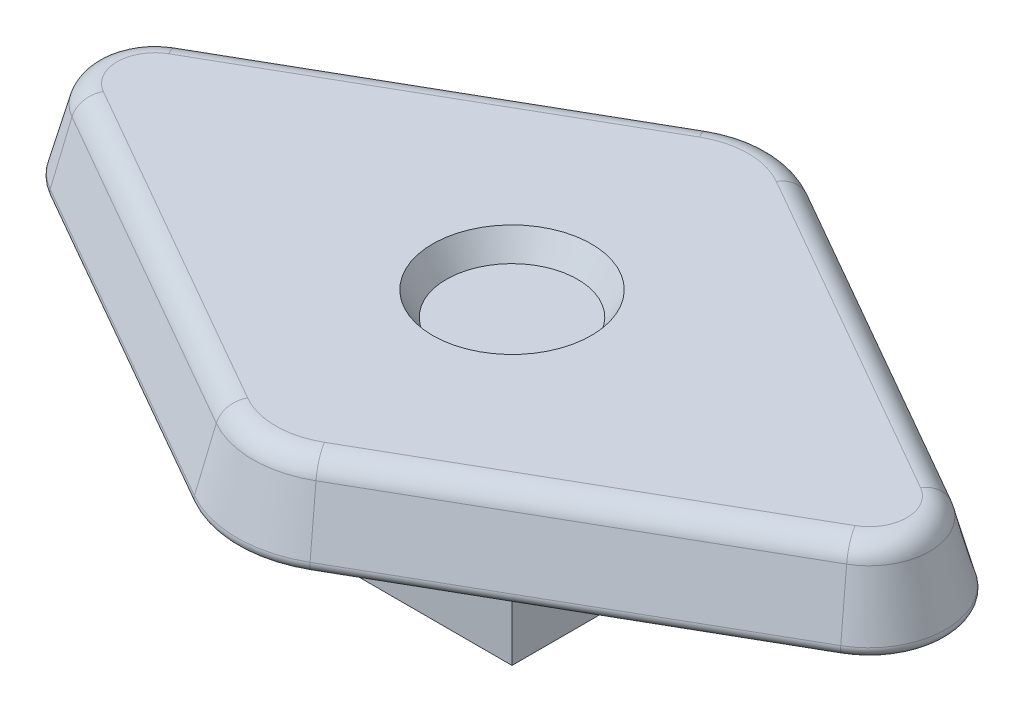
ISO-10303-21;
HEADER;
FILE_DESCRIPTION(('STEP AP214'),'2;1');
FILE_NAME('part.step','',(''),(''),'','','');
FILE_SCHEMA(('AUTOMOTIVE_DESIGN { 1 0 10303 214 1 1 1 1 }'));
ENDSEC;
DATA;
#1=APPLICATION_CONTEXT('core data for automotive mechanical design processes');
#2=APPLICATION_PROTOCOL_DEFINITION('international standard','automotive_design',2000,#1);
#3=PRODUCT_CONTEXT('',#1,'mechanical');
#4=PRODUCT('Part','Part','',(#3));
#5=PRODUCT_RELATED_PRODUCT_CATEGORY('part','',(#4));
#6=PRODUCT_DEFINITION_FORMATION('','',#4);
#7=PRODUCT_DEFINITION_CONTEXT('part definition',#1,'design');
#8=PRODUCT_DEFINITION('design','',#6,#7);
#9=PRODUCT_DEFINITION_SHAPE('','',#8);
#10=(LENGTH_UNIT() NAMED_UNIT(*) SI_UNIT(.MILLI.,.METRE.));
#11=(NAMED_UNIT(*) PLANE_ANGLE_UNIT() SI_UNIT($,.RADIAN.));
#12=(NAMED_UNIT(*) SI_UNIT($,.STERADIAN.) SOLID_ANGLE_UNIT());
#13=UNCERTAINTY_MEASURE_WITH_UNIT(LENGTH_MEASURE(1.E-05),#10,'distance_accuracy_value','');
#14=(GEOMETRIC_REPRESENTATION_CONTEXT(3) GLOBAL_UNCERTAINTY_ASSIGNED_CONTEXT((#13)) GLOBAL_UNIT_ASSIGNED_CONTEXT((#10,
#11,#12)) REPRESENTATION_CONTEXT('',''));
#15=CARTESIAN_POINT('',(0.,0.,0.));
#16=DIRECTION('',(0.,0.,1.));
#17=DIRECTION('',(1.,0.,0.));
#18=AXIS2_PLACEMENT_3D('',#15,#16,#17);
#19=CARTESIAN_POINT('',(1.27,2.54,1.27));
#20=DIRECTION('',(-1.,0.,0.));
#21=DIRECTION('',(0.,0.,1.));
#22=AXIS2_PLACEMENT_3D('',#19,#20,#21);
#23=PLANE('',#22);
#24=DIRECTION('',(0.,0.,-1.));
#25=VECTOR('',#24,1.);
#26=CARTESIAN_POINT('',(1.27,0.,1.27));
#27=LINE('',#26,#25);
#28=CARTESIAN_POINT('',(1.27,0.,1.27));
#29=VERTEX_POINT('',#28);
#30=CARTESIAN_POINT('',(1.27,0.,-1.27));
#31=VERTEX_POINT('',#30);
#32=EDGE_CURVE('E204',#29,#31,#27,.T.);
#33=ORIENTED_EDGE('',*,*,#32,.T.);
#34=DIRECTION('',(0.,-1.,0.));
#35=VECTOR('',#34,1.);
#36=CARTESIAN_POINT('',(1.27,2.54,-1.27));
#37=LINE('',#36,#35);
#38=CARTESIAN_POINT('',(1.27,2.54,-1.27));
#39=VERTEX_POINT('',#38);
#40=EDGE_CURVE('E181',#39,#31,#37,.T.);
#41=ORIENTED_EDGE('',*,*,#40,.F.);
#42=DIRECTION('',(0.,0.,-1.));
#43=VECTOR('',#42,1.);
#44=CARTESIAN_POINT('',(1.27,2.54,1.27));
#45=LINE('',#44,#43);
#46=CARTESIAN_POINT('',(1.27,2.54,1.27));
#47=VERTEX_POINT('',#46);
#48=EDGE_CURVE('E175',#47,#39,#45,.T.);
#49=ORIENTED_EDGE('',*,*,#48,.F.);
#50=DIRECTION('',(0.,-1.,0.));
#51=VECTOR('',#50,1.);
#52=CARTESIAN_POINT('',(1.27,2.54,1.27));
#53=LINE('',#52,#51);
#54=EDGE_CURVE('E178',#47,#29,#53,.T.);
#55=ORIENTED_EDGE('',*,*,#54,.T.);
#56=EDGE_LOOP('',(#33,#41,#49,#55));
#57=FACE_BOUND('',#56,.T.);
#58=ADVANCED_FACE('F35',(#57),#23,.F.);
#59=CARTESIAN_POINT('',(-1.27,2.54,-1.27));
#60=DIRECTION('',(0.,0.,1.));
#61=DIRECTION('',(1.,0.,0.));
#62=AXIS2_PLACEMENT_3D('',#59,#60,#61);
#63=PLANE('',#62);
#64=DIRECTION('',(-1.,0.,0.));
#65=VECTOR('',#64,1.);
#66=CARTESIAN_POINT('',(-1.27,0.,-1.27));
#67=LINE('',#66,#65);
#68=CARTESIAN_POINT('',(-1.27,0.,-1.27));
#69=VERTEX_POINT('',#68);
#70=EDGE_CURVE('E206',#31,#69,#67,.T.);
#71=ORIENTED_EDGE('',*,*,#70,.T.);
#72=DIRECTION('',(0.,-1.,0.));
#73=VECTOR('',#72,1.);
#74=CARTESIAN_POINT('',(-1.27,2.54,-1.27));
#75=LINE('',#74,#73);
#76=CARTESIAN_POINT('',(-1.27,2.54,-1.27));
#77=VERTEX_POINT('',#76);
#78=EDGE_CURVE('E213',#77,#69,#75,.T.);
#79=ORIENTED_EDGE('',*,*,#78,.F.);
#80=DIRECTION('',(-1.,0.,0.));
#81=VECTOR('',#80,1.);
#82=CARTESIAN_POINT('',(-1.27,2.54,-1.27));
#83=LINE('',#82,#81);
#84=EDGE_CURVE('E185',#39,#77,#83,.T.);
#85=ORIENTED_EDGE('',*,*,#84,.F.);
#86=ORIENTED_EDGE('',*,*,#40,.T.);
#87=EDGE_LOOP('',(#71,#79,#85,#86));
#88=FACE_BOUND('',#87,.T.);
#89=ADVANCED_FACE('F381',(#88),#63,.F.);
#90=CARTESIAN_POINT('',(-1.27,2.54,1.27));
#91=DIRECTION('',(1.,0.,0.));
#92=DIRECTION('',(0.,0.,-1.));
#93=AXIS2_PLACEMENT_3D('',#90,#91,#92);
#94=PLANE('',#93);
#95=DIRECTION('',(0.,0.,1.));
#96=VECTOR('',#95,1.);
#97=CARTESIAN_POINT('',(-1.27,0.,1.27));
#98=LINE('',#97,#96);
#99=CARTESIAN_POINT('',(-1.27,0.,1.27));
#100=VERTEX_POINT('',#99);
#101=EDGE_CURVE('E209',#69,#100,#98,.T.);
#102=ORIENTED_EDGE('',*,*,#101,.T.);
#103=DIRECTION('',(0.,-1.,0.));
#104=VECTOR('',#103,1.);
#105=CARTESIAN_POINT('',(-1.27,2.54,1.27));
#106=LINE('',#105,#104);
#107=CARTESIAN_POINT('',(-1.27,2.54,1.27));
#108=VERTEX_POINT('',#107);
#109=EDGE_CURVE('E195',#108,#100,#106,.T.);
#110=ORIENTED_EDGE('',*,*,#109,.F.);
#111=DIRECTION('',(0.,0.,1.));
#112=VECTOR('',#111,1.);
#113=CARTESIAN_POINT('',(-1.27,2.54,1.27));
#114=LINE('',#113,#112);
#115=EDGE_CURVE('E199',#77,#108,#114,.T.);
#116=ORIENTED_EDGE('',*,*,#115,.F.);
#117=ORIENTED_EDGE('',*,*,#78,.T.);
#118=EDGE_LOOP('',(#102,#110,#116,#117));
#119=FACE_BOUND('',#118,.T.);
#120=ADVANCED_FACE('F384',(#119),#94,.F.);
#121=CARTESIAN_POINT('',(-1.27,2.54,1.27));
#122=DIRECTION('',(0.,0.,-1.));
#123=DIRECTION('',(-1.,0.,0.));
#124=AXIS2_PLACEMENT_3D('',#121,#122,#123);
#125=PLANE('',#124);
#126=DIRECTION('',(1.,0.,0.));
#127=VECTOR('',#126,1.);
#128=CARTESIAN_POINT('',(-1.27,0.,1.27));
#129=LINE('',#128,#127);
#130=EDGE_CURVE('E186',#100,#29,#129,.T.);
#131=ORIENTED_EDGE('',*,*,#130,.T.);
#132=ORIENTED_EDGE('',*,*,#54,.F.);
#133=DIRECTION('',(1.,0.,0.));
#134=VECTOR('',#133,1.);
#135=CARTESIAN_POINT('',(-1.27,2.54,1.27));
#136=LINE('',#135,#134);
#137=EDGE_CURVE('E192',#108,#47,#136,.T.);
#138=ORIENTED_EDGE('',*,*,#137,.F.);
#139=ORIENTED_EDGE('',*,*,#109,.T.);
#140=EDGE_LOOP('',(#131,#132,#138,#139));
#141=FACE_BOUND('',#140,.T.);
#142=ADVANCED_FACE('F190',(#141),#125,.F.);
#143=CARTESIAN_POINT('',(0.,0.,0.));
#144=DIRECTION('',(0.,-1.,0.));
#145=DIRECTION('',(0.,0.,-1.));
#146=AXIS2_PLACEMENT_3D('',#143,#144,#145);
#147=PLANE('',#146);
#148=ORIENTED_EDGE('',*,*,#32,.F.);
#149=ORIENTED_EDGE('',*,*,#130,.F.);
#150=ORIENTED_EDGE('',*,*,#101,.F.);
#151=ORIENTED_EDGE('',*,*,#70,.F.);
#152=EDGE_LOOP('',(#148,#149,#150,#151));
#153=FACE_BOUND('',#152,.T.);
#154=ADVANCED_FACE('F386',(#153),#147,.T.);
#155=CARTESIAN_POINT('',(0.,2.54,-2.54));
#156=DIRECTION('',(0.,-1.,0.));
#157=DIRECTION('',(0.,0.,-1.));
#158=AXIS2_PLACEMENT_3D('',#155,#156,#157);
#159=PLANE('',#158);
#160=CARTESIAN_POINT('',(-5.715,2.54,0.));
#161=DIRECTION('',(0.,-1.,0.));
#162=DIRECTION('',(0.,0.,-1.));
#163=AXIS2_PLACEMENT_3D('',#160,#161,#162);
#164=CIRCLE('',#163,1.10449037764917);
#165=CARTESIAN_POINT('',(-6.2637362785125,2.54,0.958534032240823));
#166=VERTEX_POINT('',#165);
#167=CARTESIAN_POINT('',(-6.2637362785125,2.54,-0.958534032240823));
#168=VERTEX_POINT('',#167);
#169=EDGE_CURVE('E277',#166,#168,#164,.T.);
#170=ORIENTED_EDGE('',*,*,#169,.T.);
#171=DIRECTION('',(0.867851863300973,0.,-0.496823050355988));
#172=VECTOR('',#171,1.);
#173=CARTESIAN_POINT('',(-0.864218915488549,2.54,-4.04961996543694));
#174=LINE('',#173,#172);
#175=CARTESIAN_POINT('',(-0.864218915488549,2.54,-4.04961996543694));
#176=VERTEX_POINT('',#175);
#177=EDGE_CURVE('E291',#168,#176,#174,.T.);
#178=ORIENTED_EDGE('',*,*,#177,.T.);
#179=CARTESIAN_POINT('',(0.,2.54,-2.54));
#180=DIRECTION('',(0.,-1.,0.));
#181=DIRECTION('',(0.,0.,-1.));
#182=AXIS2_PLACEMENT_3D('',#179,#180,#181);
#183=CIRCLE('',#182,1.73949037764917);
#184=CARTESIAN_POINT('',(0.864218915488548,2.54,-4.04961996543694));
#185=VERTEX_POINT('',#184);
#186=EDGE_CURVE('E289',#176,#185,#183,.T.);
#187=ORIENTED_EDGE('',*,*,#186,.T.);
#188=DIRECTION('',(0.867851863300973,0.,0.496823050355988));
#189=VECTOR('',#188,1.);
#190=CARTESIAN_POINT('',(6.2637362785125,2.54,-0.958534032240823));
#191=LINE('',#190,#189);
#192=CARTESIAN_POINT('',(6.2637362785125,2.54,-0.958534032240823));
#193=VERTEX_POINT('',#192);
#194=EDGE_CURVE('E287',#185,#193,#191,.T.);
#195=ORIENTED_EDGE('',*,*,#194,.T.);
#196=CARTESIAN_POINT('',(5.715,2.54,0.));
#197=DIRECTION('',(0.,-1.,0.));
#198=DIRECTION('',(0.,0.,-1.));
#199=AXIS2_PLACEMENT_3D('',#196,#197,#198);
#200=CIRCLE('',#199,1.10449037764917);
#201=CARTESIAN_POINT('',(6.2637362785125,2.54,0.958534032240823));
#202=VERTEX_POINT('',#201);
#203=EDGE_CURVE('E285',#193,#202,#200,.T.);
#204=ORIENTED_EDGE('',*,*,#203,.T.);
#205=DIRECTION('',(-0.867851863300973,0.,0.496823050355988));
#206=VECTOR('',#205,1.);
#207=CARTESIAN_POINT('',(0.864218915488549,2.54,4.04961996543694));
#208=LINE('',#207,#206);
#209=CARTESIAN_POINT('',(0.864218915488549,2.54,4.04961996543694));
#210=VERTEX_POINT('',#209);
#211=EDGE_CURVE('E283',#202,#210,#208,.T.);
#212=ORIENTED_EDGE('',*,*,#211,.T.);
#213=CARTESIAN_POINT('',(0.,2.54,2.54));
#214=DIRECTION('',(0.,-1.,0.));
#215=DIRECTION('',(0.,0.,-1.));
#216=AXIS2_PLACEMENT_3D('',#213,#214,#215);
#217=CIRCLE('',#216,1.73949037764917);
#218=CARTESIAN_POINT('',(-0.864218915488548,2.54,4.04961996543694));
#219=VERTEX_POINT('',#218);
#220=EDGE_CURVE('E281',#210,#219,#217,.T.);
#221=ORIENTED_EDGE('',*,*,#220,.T.);
#222=DIRECTION('',(-0.867851863300973,0.,-0.496823050355988));
#223=VECTOR('',#222,1.);
#224=CARTESIAN_POINT('',(-6.2637362785125,2.54,0.958534032240823));
#225=LINE('',#224,#223);
#226=EDGE_CURVE('E279',#219,#166,#225,.T.);
#227=ORIENTED_EDGE('',*,*,#226,.T.);
#228=EDGE_LOOP('',(#170,#178,#187,#195,#204,#212,#221,#227));
#229=FACE_BOUND('',#228,.T.);
#230=ORIENTED_EDGE('',*,*,#48,.T.);
#231=ORIENTED_EDGE('',*,*,#84,.T.);
#232=ORIENTED_EDGE('',*,*,#115,.T.);
#233=ORIENTED_EDGE('',*,*,#137,.T.);
#234=EDGE_LOOP('',(#230,#231,#232,#233));
#235=FACE_BOUND('',#234,.T.);
#236=ADVANCED_FACE('F197',(#229,#235),#159,.T.);
#237=CARTESIAN_POINT('',(0.,2.54,-2.54));
#238=DIRECTION('',(0.,-1.,0.));
#239=DIRECTION('',(0.,0.,-1.));
#240=AXIS2_PLACEMENT_3D('',#237,#238,#239);
#241=CONICAL_SURFACE('',#240,1.905,0.261799387799149);
#242=DIRECTION('',(0.128587267478058,-0.965925826289068,-0.224616590550001));
#243=VECTOR('',#242,1.);
#244=CARTESIAN_POINT('',(0.946447910928157,2.54,-4.19325779958835));
#245=LINE('',#244,#243);
#246=CARTESIAN_POINT('',(0.798067302886125,3.65461005618406,-3.93406614760131));
#247=VERTEX_POINT('',#246);
#248=CARTESIAN_POINT('',(0.925165480848738,2.69987001872802,-4.15608159251269));
#249=VERTEX_POINT('',#248);
#250=EDGE_CURVE('E274',#247,#249,#245,.T.);
#251=ORIENTED_EDGE('',*,*,#250,.T.);
#252=CARTESIAN_POINT('',(0.,2.69987001872802,-2.54));
#253=DIRECTION('',(0.,-1.,0.));
#254=DIRECTION('',(0.,0.,-1.));
#255=AXIS2_PLACEMENT_3D('',#252,#253,#254);
#256=CIRCLE('',#255,1.86216295758788);
#257=CARTESIAN_POINT('',(-0.925165480848739,2.69987001872802,-4.15608159251269));
#258=VERTEX_POINT('',#257);
#259=EDGE_CURVE('E294',#249,#258,#256,.F.);
#260=ORIENTED_EDGE('',*,*,#259,.T.);
#261=DIRECTION('',(-0.128587267478059,-0.965925826289068,-0.224616590550001));
#262=VECTOR('',#261,1.);
#263=CARTESIAN_POINT('',(-0.946447910928158,2.54,-4.19325779958835));
#264=LINE('',#263,#262);
#265=CARTESIAN_POINT('',(-0.798067302886126,3.65461005618406,-3.93406614760131));
#266=VERTEX_POINT('',#265);
#267=EDGE_CURVE('E207',#266,#258,#264,.T.);
#268=ORIENTED_EDGE('',*,*,#267,.F.);
#269=CARTESIAN_POINT('',(0.,3.65461005618406,-2.54));
#270=DIRECTION('',(0.,1.,0.));
#271=DIRECTION('',(0.,0.,1.));
#272=AXIS2_PLACEMENT_3D('',#269,#270,#271);
#273=CIRCLE('',#272,1.60634113556987);
#274=EDGE_CURVE('E234',#266,#247,#273,.F.);
#275=ORIENTED_EDGE('',*,*,#274,.T.);
#276=EDGE_LOOP('',(#251,#260,#268,#275));
#277=FACE_BOUND('',#276,.T.);
#278=ADVANCED_FACE('F354',(#277),#241,.T.);
#279=CARTESIAN_POINT('',(-6.3459652739521,2.54,-1.10217186639223));
#280=DIRECTION('',(-0.479894215434563,0.258819045102521,-0.8382805281555));
#281=DIRECTION('',(-0.867851863300973,0.,0.496823050355988));
#282=AXIS2_PLACEMENT_3D('',#279,#280,#281);
#283=PLANE('',#282);
#284=ORIENTED_EDGE('',*,*,#267,.T.);
#285=DIRECTION('',(-0.867851863300973,0.,0.496823050355988));
#286=VECTOR('',#285,1.);
#287=CARTESIAN_POINT('',(-6.32468284387268,2.69987001872802,-1.06499565931657));
#288=LINE('',#287,#286);
#289=CARTESIAN_POINT('',(-6.32468284387268,2.69987001872802,-1.06499565931657));
#290=VERTEX_POINT('',#289);
#291=EDGE_CURVE('E251',#258,#290,#288,.T.);
#292=ORIENTED_EDGE('',*,*,#291,.T.);
#293=DIRECTION('',(-0.128587267478059,-0.965925826289068,-0.224616590550001));
#294=VECTOR('',#293,1.);
#295=CARTESIAN_POINT('',(-6.3459652739521,2.54,-1.10217186639223));
#296=LINE('',#295,#294);
#297=CARTESIAN_POINT('',(-6.19758466591007,3.65461005618406,-0.842980214405195));
#298=VERTEX_POINT('',#297);
#299=EDGE_CURVE('E361',#298,#290,#296,.T.);
#300=ORIENTED_EDGE('',*,*,#299,.F.);
#301=DIRECTION('',(-0.867851863300973,0.,0.496823050355988));
#302=VECTOR('',#301,1.);
#303=CARTESIAN_POINT('',(-6.19758466591007,3.65461005618406,-0.842980214405196));
#304=LINE('',#303,#302);
#305=EDGE_CURVE('E249',#298,#266,#304,.F.);
#306=ORIENTED_EDGE('',*,*,#305,.T.);
#307=EDGE_LOOP('',(#284,#292,#300,#306));
#308=FACE_BOUND('',#307,.T.);
#309=ADVANCED_FACE('F358',(#308),#283,.T.);
#310=CARTESIAN_POINT('',(-5.715,2.54,0.));
#311=DIRECTION('',(0.,-1.,0.));
#312=DIRECTION('',(0.,0.,1.));
#313=AXIS2_PLACEMENT_3D('',#310,#311,#312);
#314=CONICAL_SURFACE('',#313,1.27,0.261799387799149);
#315=ORIENTED_EDGE('',*,*,#299,.T.);
#316=CARTESIAN_POINT('',(-5.715,2.69987001872802,0.));
#317=DIRECTION('',(0.,-1.,0.));
#318=DIRECTION('',(0.,0.,-1.));
#319=AXIS2_PLACEMENT_3D('',#316,#317,#318);
#320=CIRCLE('',#319,1.22716295758788);
#321=CARTESIAN_POINT('',(-6.32468284387269,2.69987001872802,1.06499565931657));
#322=VERTEX_POINT('',#321);
#323=EDGE_CURVE('E11',#290,#322,#320,.F.);
#324=ORIENTED_EDGE('',*,*,#323,.T.);
#325=DIRECTION('',(-0.128587267478059,-0.965925826289068,0.224616590550001));
#326=VECTOR('',#325,1.);
#327=CARTESIAN_POINT('',(-6.34596527395211,2.54,1.10217186639223));
#328=LINE('',#327,#326);
#329=CARTESIAN_POINT('',(-6.19758466591007,3.65461005618406,0.842980214405195));
#330=VERTEX_POINT('',#329);
#331=EDGE_CURVE('E363',#330,#322,#328,.T.);
#332=ORIENTED_EDGE('',*,*,#331,.F.);
#333=CARTESIAN_POINT('',(-5.715,3.65461005618406,0.));
#334=DIRECTION('',(0.,1.,0.));
#335=DIRECTION('',(0.,0.,1.));
#336=AXIS2_PLACEMENT_3D('',#333,#334,#335);
#337=CIRCLE('',#336,0.971341135569871);
#338=EDGE_CURVE('E247',#330,#298,#337,.F.);
#339=ORIENTED_EDGE('',*,*,#338,.T.);
#340=EDGE_LOOP('',(#315,#324,#332,#339));
#341=FACE_BOUND('',#340,.T.);
#342=ADVANCED_FACE('F542',(#341),#314,.T.);
#343=CARTESIAN_POINT('',(-6.3459652739521,2.54,1.10217186639223));
#344=DIRECTION('',(-0.479894215434563,0.258819045102521,0.8382805281555));
#345=DIRECTION('',(0.867851863300973,0.,0.496823050355988));
#346=AXIS2_PLACEMENT_3D('',#343,#344,#345);
#347=PLANE('',#346);
#348=ORIENTED_EDGE('',*,*,#331,.T.);
#349=DIRECTION('',(0.867851863300973,0.,0.496823050355988));
#350=VECTOR('',#349,1.);
#351=CARTESIAN_POINT('',(-0.925165480848739,2.69987001872802,4.15608159251269));
#352=LINE('',#351,#350);
#353=CARTESIAN_POINT('',(-0.925165480848738,2.69987001872802,4.15608159251269));
#354=VERTEX_POINT('',#353);
#355=EDGE_CURVE('E44',#322,#354,#352,.T.);
#356=ORIENTED_EDGE('',*,*,#355,.T.);
#357=DIRECTION('',(-0.128587267478058,-0.965925826289068,0.224616590550001));
#358=VECTOR('',#357,1.);
#359=CARTESIAN_POINT('',(-0.946447910928157,2.54,4.19325779958835));
#360=LINE('',#359,#358);
#361=CARTESIAN_POINT('',(-0.798067302886125,3.65461005618406,3.93406614760131));
#362=VERTEX_POINT('',#361);
#363=EDGE_CURVE('E378',#362,#354,#360,.T.);
#364=ORIENTED_EDGE('',*,*,#363,.F.);
#365=DIRECTION('',(0.867851863300973,0.,0.496823050355988));
#366=VECTOR('',#365,1.);
#367=CARTESIAN_POINT('',(-6.19758466591007,3.65461005618406,0.842980214405195));
#368=LINE('',#367,#366);
#369=EDGE_CURVE('E245',#362,#330,#368,.F.);
#370=ORIENTED_EDGE('',*,*,#369,.T.);
#371=EDGE_LOOP('',(#348,#356,#364,#370));
#372=FACE_BOUND('',#371,.T.);
#373=ADVANCED_FACE('F534',(#372),#347,.T.);
#374=CARTESIAN_POINT('',(0.,2.54,2.54));
#375=DIRECTION('',(0.,-1.,0.));
#376=DIRECTION('',(0.,0.,1.));
#377=AXIS2_PLACEMENT_3D('',#374,#375,#376);
#378=CONICAL_SURFACE('',#377,1.905,0.261799387799149);
#379=ORIENTED_EDGE('',*,*,#363,.T.);
#380=CARTESIAN_POINT('',(0.,2.69987001872802,2.54));
#381=DIRECTION('',(0.,-1.,0.));
#382=DIRECTION('',(0.,0.,-1.));
#383=AXIS2_PLACEMENT_3D('',#380,#381,#382);
#384=CIRCLE('',#383,1.86216295758788);
#385=CARTESIAN_POINT('',(0.925165480848739,2.69987001872802,4.15608159251269));
#386=VERTEX_POINT('',#385);
#387=EDGE_CURVE('E302',#354,#386,#384,.F.);
#388=ORIENTED_EDGE('',*,*,#387,.T.);
#389=DIRECTION('',(0.128587267478059,-0.965925826289068,0.224616590550001));
#390=VECTOR('',#389,1.);
#391=CARTESIAN_POINT('',(0.946447910928158,2.54,4.19325779958835));
#392=LINE('',#391,#390);
#393=CARTESIAN_POINT('',(0.798067302886126,3.65461005618406,3.93406614760131));
#394=VERTEX_POINT('',#393);
#395=EDGE_CURVE('E375',#394,#386,#392,.T.);
#396=ORIENTED_EDGE('',*,*,#395,.F.);
#397=CARTESIAN_POINT('',(0.,3.65461005618406,2.54));
#398=DIRECTION('',(0.,1.,0.));
#399=DIRECTION('',(0.,0.,1.));
#400=AXIS2_PLACEMENT_3D('',#397,#398,#399);
#401=CIRCLE('',#400,1.60634113556987);
#402=EDGE_CURVE('E243',#394,#362,#401,.F.);
#403=ORIENTED_EDGE('',*,*,#402,.T.);
#404=EDGE_LOOP('',(#379,#388,#396,#403));
#405=FACE_BOUND('',#404,.T.);
#406=ADVANCED_FACE('F526',(#405),#378,.T.);
#407=CARTESIAN_POINT('',(6.3459652739521,2.54,1.10217186639223));
#408=DIRECTION('',(0.479894215434563,0.258819045102521,0.8382805281555));
#409=DIRECTION('',(0.867851863300973,0.,-0.496823050355988));
#410=AXIS2_PLACEMENT_3D('',#407,#408,#409);
#411=PLANE('',#410);
#412=ORIENTED_EDGE('',*,*,#395,.T.);
#413=DIRECTION('',(0.867851863300973,0.,-0.496823050355988));
#414=VECTOR('',#413,1.);
#415=CARTESIAN_POINT('',(6.32468284387268,2.69987001872802,1.06499565931657));
#416=LINE('',#415,#414);
#417=CARTESIAN_POINT('',(6.32468284387268,2.69987001872802,1.06499565931657));
#418=VERTEX_POINT('',#417);
#419=EDGE_CURVE('E300',#386,#418,#416,.T.);
#420=ORIENTED_EDGE('',*,*,#419,.T.);
#421=DIRECTION('',(0.128587267478059,-0.965925826289068,0.224616590550001));
#422=VECTOR('',#421,1.);
#423=CARTESIAN_POINT('',(6.3459652739521,2.54,1.10217186639223));
#424=LINE('',#423,#422);
#425=CARTESIAN_POINT('',(6.19758466591007,3.65461005618406,0.842980214405195));
#426=VERTEX_POINT('',#425);
#427=EDGE_CURVE('E372',#426,#418,#424,.T.);
#428=ORIENTED_EDGE('',*,*,#427,.F.);
#429=DIRECTION('',(0.867851863300973,0.,-0.496823050355988));
#430=VECTOR('',#429,1.);
#431=CARTESIAN_POINT('',(6.19758466591007,3.65461005618406,0.842980214405196));
#432=LINE('',#431,#430);
#433=EDGE_CURVE('E241',#426,#394,#432,.F.);
#434=ORIENTED_EDGE('',*,*,#433,.T.);
#435=EDGE_LOOP('',(#412,#420,#428,#434));
#436=FACE_BOUND('',#435,.T.);
#437=ADVANCED_FACE('F518',(#436),#411,.T.);
#438=CARTESIAN_POINT('',(5.715,2.54,0.));
#439=DIRECTION('',(0.,-1.,0.));
#440=DIRECTION('',(0.,0.,-1.));
#441=AXIS2_PLACEMENT_3D('',#438,#439,#440);
#442=CONICAL_SURFACE('',#441,1.27,0.261799387799149);
#443=ORIENTED_EDGE('',*,*,#427,.T.);
#444=CARTESIAN_POINT('',(5.715,2.69987001872802,0.));
#445=DIRECTION('',(0.,-1.,0.));
#446=DIRECTION('',(0.,0.,-1.));
#447=AXIS2_PLACEMENT_3D('',#444,#445,#446);
#448=CIRCLE('',#447,1.22716295758788);
#449=CARTESIAN_POINT('',(6.32468284387268,2.69987001872802,-1.06499565931657));
#450=VERTEX_POINT('',#449);
#451=EDGE_CURVE('E298',#418,#450,#448,.F.);
#452=ORIENTED_EDGE('',*,*,#451,.T.);
#453=DIRECTION('',(0.128587267478059,-0.965925826289068,-0.224616590550001));
#454=VECTOR('',#453,1.);
#455=CARTESIAN_POINT('',(6.3459652739521,2.54,-1.10217186639223));
#456=LINE('',#455,#454);
#457=CARTESIAN_POINT('',(6.19758466591007,3.65461005618406,-0.842980214405195));
#458=VERTEX_POINT('',#457);
#459=EDGE_CURVE('E369',#458,#450,#456,.T.);
#460=ORIENTED_EDGE('',*,*,#459,.F.);
#461=CARTESIAN_POINT('',(5.715,3.65461005618406,0.));
#462=DIRECTION('',(0.,1.,0.));
#463=DIRECTION('',(0.,0.,1.));
#464=AXIS2_PLACEMENT_3D('',#461,#462,#463);
#465=CIRCLE('',#464,0.971341135569871);
#466=EDGE_CURVE('E239',#458,#426,#465,.F.);
#467=ORIENTED_EDGE('',*,*,#466,.T.);
#468=EDGE_LOOP('',(#443,#452,#460,#467));
#469=FACE_BOUND('',#468,.T.);
#470=ADVANCED_FACE('F511',(#469),#442,.T.);
#471=CARTESIAN_POINT('',(6.3459652739521,2.54,-1.10217186639223));
#472=DIRECTION('',(0.479894215434563,0.258819045102521,-0.8382805281555));
#473=DIRECTION('',(-0.867851863300973,0.,-0.496823050355988));
#474=AXIS2_PLACEMENT_3D('',#471,#472,#473);
#475=PLANE('',#474);
#476=ORIENTED_EDGE('',*,*,#459,.T.);
#477=DIRECTION('',(-0.867851863300973,0.,-0.496823050355988));
#478=VECTOR('',#477,1.);
#479=CARTESIAN_POINT('',(0.925165480848739,2.69987001872802,-4.15608159251269));
#480=LINE('',#479,#478);
#481=EDGE_CURVE('E296',#450,#249,#480,.T.);
#482=ORIENTED_EDGE('',*,*,#481,.T.);
#483=ORIENTED_EDGE('',*,*,#250,.F.);
#484=DIRECTION('',(-0.867851863300973,0.,-0.496823050355988));
#485=VECTOR('',#484,1.);
#486=CARTESIAN_POINT('',(6.19758466591007,3.65461005618406,-0.842980214405196));
#487=LINE('',#486,#485);
#488=EDGE_CURVE('E237',#247,#458,#487,.F.);
#489=ORIENTED_EDGE('',*,*,#488,.T.);
#490=EDGE_LOOP('',(#476,#482,#483,#489));
#491=FACE_BOUND('',#490,.T.);
#492=ADVANCED_FACE('F503',(#491),#475,.T.);
#493=CARTESIAN_POINT('',(0.,3.937,-2.54));
#494=DIRECTION('',(0.,-1.,0.));
#495=DIRECTION('',(0.,0.,-1.));
#496=AXIS2_PLACEMENT_3D('',#493,#494,#495);
#497=PLANE('',#496);
#498=CARTESIAN_POINT('',(0.,3.937,0.));
#499=DIRECTION('',(0.,1.,0.));
#500=DIRECTION('',(0.,0.,1.));
#501=AXIS2_PLACEMENT_3D('',#498,#499,#500);
#502=CIRCLE('',#501,1.27);
#503=CARTESIAN_POINT('',(0.,3.937,1.27));
#504=VERTEX_POINT('',#503);
#505=EDGE_CURVE('E734',#504,#504,#502,.T.);
#506=ORIENTED_EDGE('',*,*,#505,.F.);
#507=EDGE_LOOP('',(#506));
#508=FACE_BOUND('',#507,.T.);
#509=DIRECTION('',(0.867851863300973,0.,0.496823050355988));
#510=VECTOR('',#509,1.);
#511=CARTESIAN_POINT('',(0.615227606805557,3.937,-3.61468126637407));
#512=LINE('',#511,#510);
#513=CARTESIAN_POINT('',(6.0147449698295,3.937,-0.52359533317795));
#514=VERTEX_POINT('',#513);
#515=CARTESIAN_POINT('',(0.615227606805557,3.937,-3.61468126637407));
#516=VERTEX_POINT('',#515);
#517=EDGE_CURVE('E229',#514,#516,#512,.F.);
#518=ORIENTED_EDGE('',*,*,#517,.T.);
#519=CARTESIAN_POINT('',(0.,3.937,-2.54));
#520=DIRECTION('',(0.,-1.,0.));
#521=DIRECTION('',(0.,0.,-1.));
#522=AXIS2_PLACEMENT_3D('',#519,#520,#521);
#523=CIRCLE('',#522,1.23832339575374);
#524=CARTESIAN_POINT('',(-0.615227606805557,3.937,-3.61468126637407));
#525=VERTEX_POINT('',#524);
#526=EDGE_CURVE('E231',#516,#525,#523,.F.);
#527=ORIENTED_EDGE('',*,*,#526,.T.);
#528=DIRECTION('',(0.867851863300973,0.,-0.496823050355988));
#529=VECTOR('',#528,1.);
#530=CARTESIAN_POINT('',(-0.615227606805557,3.937,-3.61468126637407));
#531=LINE('',#530,#529);
#532=CARTESIAN_POINT('',(-6.0147449698295,3.937,-0.52359533317795));
#533=VERTEX_POINT('',#532);
#534=EDGE_CURVE('E217',#525,#533,#531,.F.);
#535=ORIENTED_EDGE('',*,*,#534,.T.);
#536=CARTESIAN_POINT('',(-5.715,3.937,0.));
#537=DIRECTION('',(0.,-1.,0.));
#538=DIRECTION('',(0.,0.,-1.));
#539=AXIS2_PLACEMENT_3D('',#536,#537,#538);
#540=CIRCLE('',#539,0.603323395753736);
#541=CARTESIAN_POINT('',(-6.01474496982951,3.937,0.52359533317795));
#542=VERTEX_POINT('',#541);
#543=EDGE_CURVE('E219',#533,#542,#540,.F.);
#544=ORIENTED_EDGE('',*,*,#543,.T.);
#545=DIRECTION('',(-0.867851863300973,0.,-0.496823050355988));
#546=VECTOR('',#545,1.);
#547=CARTESIAN_POINT('',(-2.80556516151573,3.937,2.36076889807972));
#548=LINE('',#547,#546);
#549=CARTESIAN_POINT('',(-0.615227606805557,3.937,3.61468126637407));
#550=VERTEX_POINT('',#549);
#551=EDGE_CURVE('E221',#542,#550,#548,.F.);
#552=ORIENTED_EDGE('',*,*,#551,.T.);
#553=CARTESIAN_POINT('',(0.,3.937,2.54));
#554=DIRECTION('',(0.,-1.,0.));
#555=DIRECTION('',(0.,0.,-1.));
#556=AXIS2_PLACEMENT_3D('',#553,#554,#555);
#557=CIRCLE('',#556,1.23832339575374);
#558=CARTESIAN_POINT('',(0.615227606805558,3.937,3.61468126637407));
#559=VERTEX_POINT('',#558);
#560=EDGE_CURVE('E223',#550,#559,#557,.F.);
#561=ORIENTED_EDGE('',*,*,#560,.T.);
#562=DIRECTION('',(-0.867851863300973,0.,0.496823050355988));
#563=VECTOR('',#562,1.);
#564=CARTESIAN_POINT('',(2.80556516151573,3.937,2.36076889807972));
#565=LINE('',#564,#563);
#566=CARTESIAN_POINT('',(6.0147449698295,3.937,0.52359533317795));
#567=VERTEX_POINT('',#566);
#568=EDGE_CURVE('E225',#559,#567,#565,.F.);
#569=ORIENTED_EDGE('',*,*,#568,.T.);
#570=CARTESIAN_POINT('',(5.715,3.937,0.));
#571=DIRECTION('',(0.,-1.,0.));
#572=DIRECTION('',(0.,0.,-1.));
#573=AXIS2_PLACEMENT_3D('',#570,#571,#572);
#574=CIRCLE('',#573,0.603323395753736);
#575=EDGE_CURVE('E227',#567,#514,#574,.F.);
#576=ORIENTED_EDGE('',*,*,#575,.T.);
#577=EDGE_LOOP('',(#518,#527,#535,#544,#552,#561,#569,#576));
#578=FACE_BOUND('',#577,.T.);
#579=ADVANCED_FACE('F435',(#508,#578),#497,.F.);
#580=CARTESIAN_POINT('',(0.,3.556,2.54));
#581=DIRECTION('',(0.,-1.,0.));
#582=DIRECTION('',(0.,0.,-1.));
#583=AXIS2_PLACEMENT_3D('',#580,#581,#582);
#584=TOROIDAL_SURFACE('',#583,1.23832339575374,0.381);
#585=CARTESIAN_POINT('',(-0.615227606805557,3.556,3.61468126637407));
#586=DIRECTION('',(-0.867851863300973,0.,-0.496823050355988));
#587=DIRECTION('',(-0.496823050355988,0.,0.867851863300973));
#588=AXIS2_PLACEMENT_3D('',#585,#586,#587);
#589=CIRCLE('',#588,0.381);
#590=EDGE_CURVE('E268',#362,#550,#589,.T.);
#591=ORIENTED_EDGE('',*,*,#590,.F.);
#592=ORIENTED_EDGE('',*,*,#402,.F.);
#593=CARTESIAN_POINT('',(0.615227606805558,3.556,3.61468126637407));
#594=DIRECTION('',(0.867851863300973,0.,-0.496823050355988));
#595=DIRECTION('',(-0.496823050355988,0.,-0.867851863300973));
#596=AXIS2_PLACEMENT_3D('',#593,#594,#595);
#597=CIRCLE('',#596,0.381);
#598=EDGE_CURVE('E271',#559,#394,#597,.T.);
#599=ORIENTED_EDGE('',*,*,#598,.F.);
#600=ORIENTED_EDGE('',*,*,#560,.F.);
#601=EDGE_LOOP('',(#591,#592,#599,#600));
#602=FACE_BOUND('',#601,.T.);
#603=ADVANCED_FACE('F431',(#602),#584,.T.);
#604=CARTESIAN_POINT('',(2.80556516151573,3.556,2.36076889807972));
#605=DIRECTION('',(-0.867851863300973,0.,0.496823050355988));
#606=DIRECTION('',(0.496823050355988,0.,0.867851863300973));
#607=AXIS2_PLACEMENT_3D('',#604,#605,#606);
#608=CYLINDRICAL_SURFACE('',#607,0.381);
#609=ORIENTED_EDGE('',*,*,#598,.T.);
#610=ORIENTED_EDGE('',*,*,#433,.F.);
#611=CARTESIAN_POINT('',(6.0147449698295,3.556,0.52359533317795));
#612=DIRECTION('',(0.867851863300973,0.,-0.496823050355989));
#613=DIRECTION('',(-0.496823050355989,0.,-0.867851863300973));
#614=AXIS2_PLACEMENT_3D('',#611,#612,#613);
#615=CIRCLE('',#614,0.381);
#616=EDGE_CURVE('E265',#567,#426,#615,.T.);
#617=ORIENTED_EDGE('',*,*,#616,.F.);
#618=ORIENTED_EDGE('',*,*,#568,.F.);
#619=EDGE_LOOP('',(#609,#610,#617,#618));
#620=FACE_BOUND('',#619,.T.);
#621=ADVANCED_FACE('F427',(#620),#608,.T.);
#622=CARTESIAN_POINT('',(-2.80556516151573,3.556,2.36076889807972));
#623=DIRECTION('',(-0.867851863300973,0.,-0.496823050355988));
#624=DIRECTION('',(-0.496823050355988,0.,0.867851863300973));
#625=AXIS2_PLACEMENT_3D('',#622,#623,#624);
#626=CYLINDRICAL_SURFACE('',#625,0.381);
#627=ORIENTED_EDGE('',*,*,#590,.T.);
#628=ORIENTED_EDGE('',*,*,#551,.F.);
#629=CARTESIAN_POINT('',(-6.01474496982951,3.556,0.52359533317795));
#630=DIRECTION('',(-0.867851863300973,0.,-0.496823050355989));
#631=DIRECTION('',(-0.496823050355989,0.,0.867851863300973));
#632=AXIS2_PLACEMENT_3D('',#629,#630,#631);
#633=CIRCLE('',#632,0.381);
#634=EDGE_CURVE('E262',#330,#542,#633,.T.);
#635=ORIENTED_EDGE('',*,*,#634,.F.);
#636=ORIENTED_EDGE('',*,*,#369,.F.);
#637=EDGE_LOOP('',(#627,#628,#635,#636));
#638=FACE_BOUND('',#637,.T.);
#639=ADVANCED_FACE('F423',(#638),#626,.T.);
#640=CARTESIAN_POINT('',(5.715,3.556,0.));
#641=DIRECTION('',(0.,-1.,0.));
#642=DIRECTION('',(0.,0.,-1.));
#643=AXIS2_PLACEMENT_3D('',#640,#641,#642);
#644=TOROIDAL_SURFACE('',#643,0.603323395753736,0.381);
#645=ORIENTED_EDGE('',*,*,#616,.T.);
#646=ORIENTED_EDGE('',*,*,#466,.F.);
#647=CARTESIAN_POINT('',(6.0147449698295,3.556,-0.52359533317795));
#648=DIRECTION('',(-0.867851863300973,0.,-0.496823050355989));
#649=DIRECTION('',(-0.496823050355989,0.,0.867851863300973));
#650=AXIS2_PLACEMENT_3D('',#647,#648,#649);
#651=CIRCLE('',#650,0.381);
#652=EDGE_CURVE('E259',#514,#458,#651,.T.);
#653=ORIENTED_EDGE('',*,*,#652,.F.);
#654=ORIENTED_EDGE('',*,*,#575,.F.);
#655=EDGE_LOOP('',(#645,#646,#653,#654));
#656=FACE_BOUND('',#655,.T.);
#657=ADVANCED_FACE('F419',(#656),#644,.T.);
#658=CARTESIAN_POINT('',(-5.715,3.556,0.));
#659=DIRECTION('',(0.,-1.,0.));
#660=DIRECTION('',(0.,0.,-1.));
#661=AXIS2_PLACEMENT_3D('',#658,#659,#660);
#662=TOROIDAL_SURFACE('',#661,0.603323395753736,0.381);
#663=ORIENTED_EDGE('',*,*,#634,.T.);
#664=ORIENTED_EDGE('',*,*,#543,.F.);
#665=CARTESIAN_POINT('',(-6.0147449698295,3.556,-0.52359533317795));
#666=DIRECTION('',(0.867851863300973,0.,-0.496823050355989));
#667=DIRECTION('',(-0.496823050355989,0.,-0.867851863300973));
#668=AXIS2_PLACEMENT_3D('',#665,#666,#667);
#669=CIRCLE('',#668,0.381);
#670=EDGE_CURVE('E256',#298,#533,#669,.T.);
#671=ORIENTED_EDGE('',*,*,#670,.F.);
#672=ORIENTED_EDGE('',*,*,#338,.F.);
#673=EDGE_LOOP('',(#663,#664,#671,#672));
#674=FACE_BOUND('',#673,.T.);
#675=ADVANCED_FACE('F415',(#674),#662,.T.);
#676=CARTESIAN_POINT('',(0.615227606805557,3.556,-3.61468126637407));
#677=DIRECTION('',(0.867851863300973,0.,0.496823050355988));
#678=DIRECTION('',(0.496823050355988,0.,-0.867851863300973));
#679=AXIS2_PLACEMENT_3D('',#676,#677,#678);
#680=CYLINDRICAL_SURFACE('',#679,0.381);
#681=ORIENTED_EDGE('',*,*,#652,.T.);
#682=ORIENTED_EDGE('',*,*,#488,.F.);
#683=CARTESIAN_POINT('',(0.615227606805557,3.556,-3.61468126637407));
#684=DIRECTION('',(-0.867851863300974,0.,-0.496823050355988));
#685=DIRECTION('',(-0.496823050355988,0.,0.867851863300974));
#686=AXIS2_PLACEMENT_3D('',#683,#684,#685);
#687=CIRCLE('',#686,0.381);
#688=EDGE_CURVE('E254',#516,#247,#687,.T.);
#689=ORIENTED_EDGE('',*,*,#688,.F.);
#690=ORIENTED_EDGE('',*,*,#517,.F.);
#691=EDGE_LOOP('',(#681,#682,#689,#690));
#692=FACE_BOUND('',#691,.T.);
#693=ADVANCED_FACE('F411',(#692),#680,.T.);
#694=CARTESIAN_POINT('',(-0.615227606805557,3.556,-3.61468126637407));
#695=DIRECTION('',(0.867851863300973,0.,-0.496823050355988));
#696=DIRECTION('',(-0.496823050355988,0.,-0.867851863300973));
#697=AXIS2_PLACEMENT_3D('',#694,#695,#696);
#698=CYLINDRICAL_SURFACE('',#697,0.381);
#699=ORIENTED_EDGE('',*,*,#670,.T.);
#700=ORIENTED_EDGE('',*,*,#534,.F.);
#701=CARTESIAN_POINT('',(-0.615227606805558,3.556,-3.61468126637407));
#702=DIRECTION('',(0.867851863300973,0.,-0.496823050355988));
#703=DIRECTION('',(-0.496823050355988,0.,-0.867851863300973));
#704=AXIS2_PLACEMENT_3D('',#701,#702,#703);
#705=CIRCLE('',#704,0.381);
#706=EDGE_CURVE('E252',#266,#525,#705,.T.);
#707=ORIENTED_EDGE('',*,*,#706,.F.);
#708=ORIENTED_EDGE('',*,*,#305,.F.);
#709=EDGE_LOOP('',(#699,#700,#707,#708));
#710=FACE_BOUND('',#709,.T.);
#711=ADVANCED_FACE('F407',(#710),#698,.T.);
#712=CARTESIAN_POINT('',(0.,3.556,-2.54));
#713=DIRECTION('',(0.,-1.,0.));
#714=DIRECTION('',(0.,0.,-1.));
#715=AXIS2_PLACEMENT_3D('',#712,#713,#714);
#716=TOROIDAL_SURFACE('',#715,1.23832339575374,0.381);
#717=ORIENTED_EDGE('',*,*,#688,.T.);
#718=ORIENTED_EDGE('',*,*,#274,.F.);
#719=ORIENTED_EDGE('',*,*,#706,.T.);
#720=ORIENTED_EDGE('',*,*,#526,.F.);
#721=EDGE_LOOP('',(#717,#718,#719,#720));
#722=FACE_BOUND('',#721,.T.);
#723=ADVANCED_FACE('F404',(#722),#716,.T.);
#724=CARTESIAN_POINT('',(6.2637362785125,2.667,0.958534032240823));
#725=DIRECTION('',(0.867851863300973,0.,-0.496823050355988));
#726=DIRECTION('',(-0.496823050355988,0.,-0.867851863300973));
#727=AXIS2_PLACEMENT_3D('',#724,#725,#726);
#728=CYLINDRICAL_SURFACE('',#727,0.127);
#729=CARTESIAN_POINT('',(0.864218915488549,2.667,4.04961996543694));
#730=DIRECTION('',(-0.867851863300974,0.,0.496823050355988));
#731=DIRECTION('',(0.496823050355988,0.,0.867851863300974));
#732=AXIS2_PLACEMENT_3D('',#729,#730,#731);
#733=CIRCLE('',#732,0.127);
#734=EDGE_CURVE('E321',#210,#386,#733,.T.);
#735=ORIENTED_EDGE('',*,*,#734,.F.);
#736=ORIENTED_EDGE('',*,*,#211,.F.);
#737=CARTESIAN_POINT('',(6.2637362785125,2.667,0.958534032240824));
#738=DIRECTION('',(0.867851863300974,0.,-0.496823050355987));
#739=DIRECTION('',(-0.496823050355987,0.,-0.867851863300974));
#740=AXIS2_PLACEMENT_3D('',#737,#738,#739);
#741=CIRCLE('',#740,0.127);
#742=EDGE_CURVE('E39',#418,#202,#741,.T.);
#743=ORIENTED_EDGE('',*,*,#742,.F.);
#744=ORIENTED_EDGE('',*,*,#419,.F.);
#745=EDGE_LOOP('',(#735,#736,#743,#744));
#746=FACE_BOUND('',#745,.T.);
#747=ADVANCED_FACE('F37',(#746),#728,.T.);
#748=CARTESIAN_POINT('',(5.715,2.667,0.));
#749=DIRECTION('',(0.,-1.,0.));
#750=DIRECTION('',(0.,0.,-1.));
#751=AXIS2_PLACEMENT_3D('',#748,#749,#750);
#752=TOROIDAL_SURFACE('',#751,1.10449037764917,0.127);
#753=ORIENTED_EDGE('',*,*,#742,.T.);
#754=ORIENTED_EDGE('',*,*,#203,.F.);
#755=CARTESIAN_POINT('',(6.2637362785125,2.667,-0.958534032240823));
#756=DIRECTION('',(-0.867851863300974,0.,-0.496823050355987));
#757=DIRECTION('',(-0.496823050355987,0.,0.867851863300974));
#758=AXIS2_PLACEMENT_3D('',#755,#756,#757);
#759=CIRCLE('',#758,0.127);
#760=EDGE_CURVE('E319',#450,#193,#759,.T.);
#761=ORIENTED_EDGE('',*,*,#760,.F.);
#762=ORIENTED_EDGE('',*,*,#451,.F.);
#763=EDGE_LOOP('',(#753,#754,#761,#762));
#764=FACE_BOUND('',#763,.T.);
#765=ADVANCED_FACE('F332',(#764),#752,.T.);
#766=CARTESIAN_POINT('',(0.,2.667,2.54));
#767=DIRECTION('',(0.,-1.,0.));
#768=DIRECTION('',(0.,0.,-1.));
#769=AXIS2_PLACEMENT_3D('',#766,#767,#768);
#770=TOROIDAL_SURFACE('',#769,1.73949037764917,0.127);
#771=ORIENTED_EDGE('',*,*,#734,.T.);
#772=ORIENTED_EDGE('',*,*,#387,.F.);
#773=CARTESIAN_POINT('',(-0.864218915488548,2.667,4.04961996543694));
#774=DIRECTION('',(-0.867851863300973,0.,-0.49682305035599));
#775=DIRECTION('',(-0.49682305035599,0.,0.867851863300973));
#776=AXIS2_PLACEMENT_3D('',#773,#774,#775);
#777=CIRCLE('',#776,0.127);
#778=EDGE_CURVE('E316',#219,#354,#777,.T.);
#779=ORIENTED_EDGE('',*,*,#778,.F.);
#780=ORIENTED_EDGE('',*,*,#220,.F.);
#781=EDGE_LOOP('',(#771,#772,#779,#780));
#782=FACE_BOUND('',#781,.T.);
#783=ADVANCED_FACE('F454',(#782),#770,.T.);
#784=CARTESIAN_POINT('',(6.2637362785125,2.667,-0.958534032240823));
#785=DIRECTION('',(-0.867851863300973,0.,-0.496823050355988));
#786=DIRECTION('',(-0.496823050355988,0.,0.867851863300973));
#787=AXIS2_PLACEMENT_3D('',#784,#785,#786);
#788=CYLINDRICAL_SURFACE('',#787,0.127);
#789=ORIENTED_EDGE('',*,*,#760,.T.);
#790=ORIENTED_EDGE('',*,*,#194,.F.);
#791=CARTESIAN_POINT('',(0.864218915488548,2.667,-4.04961996543694));
#792=DIRECTION('',(-0.867851863300974,0.,-0.496823050355987));
#793=DIRECTION('',(-0.496823050355987,0.,0.867851863300974));
#794=AXIS2_PLACEMENT_3D('',#791,#792,#793);
#795=CIRCLE('',#794,0.127);
#796=EDGE_CURVE('E313',#249,#185,#795,.T.);
#797=ORIENTED_EDGE('',*,*,#796,.F.);
#798=ORIENTED_EDGE('',*,*,#481,.F.);
#799=EDGE_LOOP('',(#789,#790,#797,#798));
#800=FACE_BOUND('',#799,.T.);
#801=ADVANCED_FACE('F343',(#800),#788,.T.);
#802=CARTESIAN_POINT('',(-6.2637362785125,2.667,0.958534032240823));
#803=DIRECTION('',(0.867851863300973,0.,0.496823050355988));
#804=DIRECTION('',(0.496823050355988,0.,-0.867851863300973));
#805=AXIS2_PLACEMENT_3D('',#802,#803,#804);
#806=CYLINDRICAL_SURFACE('',#805,0.127);
#807=ORIENTED_EDGE('',*,*,#778,.T.);
#808=ORIENTED_EDGE('',*,*,#355,.F.);
#809=CARTESIAN_POINT('',(-6.2637362785125,2.667,0.958534032240823));
#810=DIRECTION('',(-0.867851863300974,0.,-0.496823050355987));
#811=DIRECTION('',(-0.496823050355987,0.,0.867851863300974));
#812=AXIS2_PLACEMENT_3D('',#809,#810,#811);
#813=CIRCLE('',#812,0.127);
#814=EDGE_CURVE('E310',#166,#322,#813,.T.);
#815=ORIENTED_EDGE('',*,*,#814,.F.);
#816=ORIENTED_EDGE('',*,*,#226,.F.);
#817=EDGE_LOOP('',(#807,#808,#815,#816));
#818=FACE_BOUND('',#817,.T.);
#819=ADVANCED_FACE('F448',(#818),#806,.T.);
#820=CARTESIAN_POINT('',(0.,2.667,-2.54));
#821=DIRECTION('',(0.,-1.,0.));
#822=DIRECTION('',(0.,0.,-1.));
#823=AXIS2_PLACEMENT_3D('',#820,#821,#822);
#824=TOROIDAL_SURFACE('',#823,1.73949037764917,0.127);
#825=ORIENTED_EDGE('',*,*,#796,.T.);
#826=ORIENTED_EDGE('',*,*,#186,.F.);
#827=CARTESIAN_POINT('',(-0.864218915488549,2.667,-4.04961996543694));
#828=DIRECTION('',(-0.867851863300973,0.,0.496823050355988));
#829=DIRECTION('',(0.496823050355988,0.,0.867851863300973));
#830=AXIS2_PLACEMENT_3D('',#827,#828,#829);
#831=CIRCLE('',#830,0.127);
#832=EDGE_CURVE('E307',#258,#176,#831,.T.);
#833=ORIENTED_EDGE('',*,*,#832,.F.);
#834=ORIENTED_EDGE('',*,*,#259,.F.);
#835=EDGE_LOOP('',(#825,#826,#833,#834));
#836=FACE_BOUND('',#835,.T.);
#837=ADVANCED_FACE('F347',(#836),#824,.T.);
#838=CARTESIAN_POINT('',(-5.715,2.667,0.));
#839=DIRECTION('',(0.,-1.,0.));
#840=DIRECTION('',(0.,0.,-1.));
#841=AXIS2_PLACEMENT_3D('',#838,#839,#840);
#842=TOROIDAL_SURFACE('',#841,1.10449037764917,0.127);
#843=ORIENTED_EDGE('',*,*,#814,.T.);
#844=ORIENTED_EDGE('',*,*,#323,.F.);
#845=CARTESIAN_POINT('',(-6.2637362785125,2.667,-0.958534032240823));
#846=DIRECTION('',(0.867851863300975,0.,-0.496823050355986));
#847=DIRECTION('',(-0.496823050355986,0.,-0.867851863300975));
#848=AXIS2_PLACEMENT_3D('',#845,#846,#847);
#849=CIRCLE('',#848,0.127);
#850=EDGE_CURVE('E305',#168,#290,#849,.T.);
#851=ORIENTED_EDGE('',*,*,#850,.F.);
#852=ORIENTED_EDGE('',*,*,#169,.F.);
#853=EDGE_LOOP('',(#843,#844,#851,#852));
#854=FACE_BOUND('',#853,.T.);
#855=ADVANCED_FACE('F441',(#854),#842,.T.);
#856=CARTESIAN_POINT('',(-6.2637362785125,2.667,-0.958534032240823));
#857=DIRECTION('',(-0.867851863300973,0.,0.496823050355988));
#858=DIRECTION('',(0.496823050355988,0.,0.867851863300973));
#859=AXIS2_PLACEMENT_3D('',#856,#857,#858);
#860=CYLINDRICAL_SURFACE('',#859,0.127);
#861=ORIENTED_EDGE('',*,*,#832,.T.);
#862=ORIENTED_EDGE('',*,*,#177,.F.);
#863=ORIENTED_EDGE('',*,*,#850,.T.);
#864=ORIENTED_EDGE('',*,*,#291,.F.);
#865=EDGE_LOOP('',(#861,#862,#863,#864));
#866=FACE_BOUND('',#865,.T.);
#867=ADVANCED_FACE('F437',(#866),#860,.T.);
#868=CARTESIAN_POINT('',(0.,3.937,0.));
#869=DIRECTION('',(0.,1.,0.));
#870=DIRECTION('',(0.,0.,1.));
#871=AXIS2_PLACEMENT_3D('',#868,#869,#870);
#872=CONICAL_SURFACE('',#871,1.27,0.5235987755983);
#873=CARTESIAN_POINT('',(0.,3.556,0.));
#874=DIRECTION('',(0.,1.,0.));
#875=DIRECTION('',(0.,0.,1.));
#876=AXIS2_PLACEMENT_3D('',#873,#874,#875);
#877=CIRCLE('',#876,1.05002954743875);
#878=CARTESIAN_POINT('',(0.,3.556,1.05002954743875));
#879=VERTEX_POINT('',#878);
#880=EDGE_CURVE('E308',#879,#879,#877,.T.);
#881=ORIENTED_EDGE('',*,*,#880,.F.);
#882=EDGE_LOOP('',(#881));
#883=FACE_BOUND('',#882,.T.);
#884=ORIENTED_EDGE('',*,*,#505,.T.);
#885=EDGE_LOOP('',(#884));
#886=FACE_BOUND('',#885,.T.);
#887=ADVANCED_FACE('F440',(#883,#886),#872,.F.);
#888=CARTESIAN_POINT('',(0.,3.556,0.));
#889=DIRECTION('',(0.,1.,0.));
#890=DIRECTION('',(0.,0.,1.));
#891=AXIS2_PLACEMENT_3D('',#888,#889,#890);
#892=PLANE('',#891);
#893=ORIENTED_EDGE('',*,*,#880,.T.);
#894=EDGE_LOOP('',(#893));
#895=FACE_BOUND('',#894,.T.);
#896=ADVANCED_FACE('F678',(#895),#892,.T.);
#897=CLOSED_SHELL('',(#58,#89,#120,#142,#154,#236,#278,#309,#342,#373,#406,#437,#470,#492,#579,
#603,#621,#639,#657,#675,#693,#711,#723,#747,#765,#783,#801,#819,#837,#855,#867,#887,#896));
#898=MANIFOLD_SOLID_BREP('B2',#897);
#899=ADVANCED_BREP_SHAPE_REPRESENTATION('',(#18,#898),#14);
#900=SHAPE_DEFINITION_REPRESENTATION(#9,#899);
ENDSEC;
END-ISO-10303-21;
